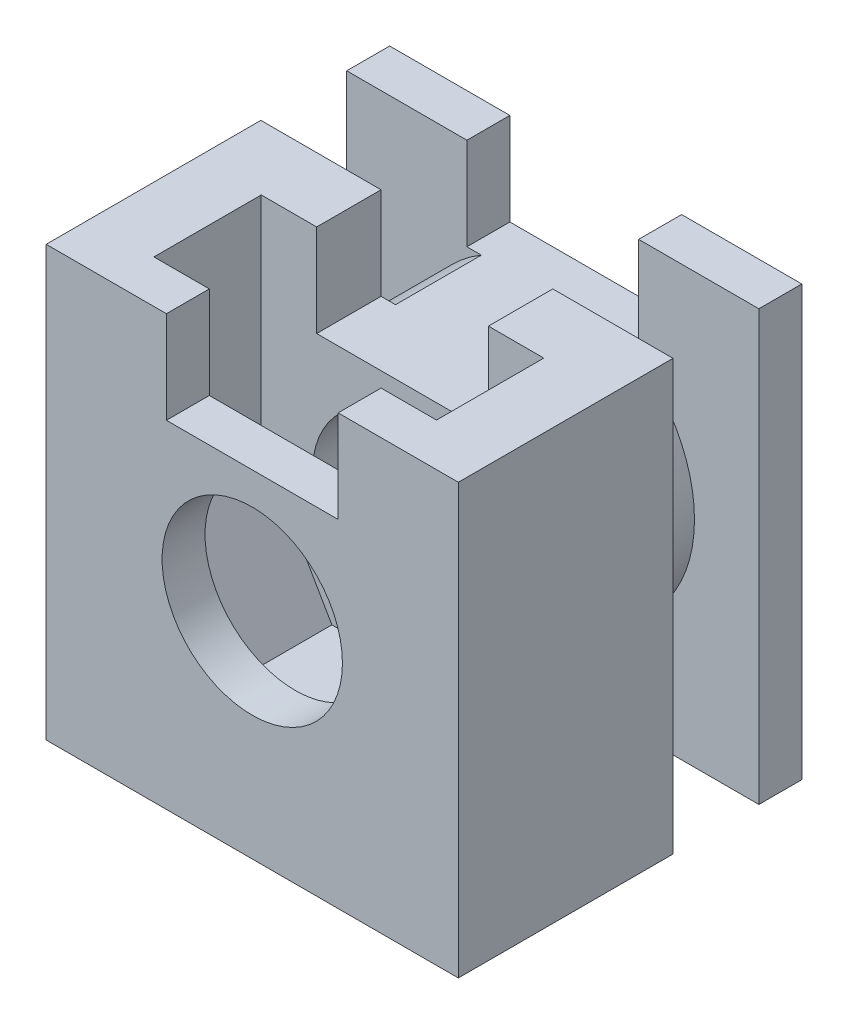
ISO-10303-21;
HEADER;
FILE_DESCRIPTION(('STEP AP214'),'2;1');
FILE_NAME('part.step','',(''),(''),'','','');
FILE_SCHEMA(('AUTOMOTIVE_DESIGN { 1 0 10303 214 1 1 1 1 }'));
ENDSEC;
DATA;
#1=APPLICATION_CONTEXT('core data for automotive mechanical design processes');
#2=APPLICATION_PROTOCOL_DEFINITION('international standard','automotive_design',2000,#1);
#3=PRODUCT_CONTEXT('',#1,'mechanical');
#4=PRODUCT('Part','Part','',(#3));
#5=PRODUCT_RELATED_PRODUCT_CATEGORY('part','',(#4));
#6=PRODUCT_DEFINITION_FORMATION('','',#4);
#7=PRODUCT_DEFINITION_CONTEXT('part definition',#1,'design');
#8=PRODUCT_DEFINITION('design','',#6,#7);
#9=PRODUCT_DEFINITION_SHAPE('','',#8);
#10=(LENGTH_UNIT() NAMED_UNIT(*) SI_UNIT(.MILLI.,.METRE.));
#11=(NAMED_UNIT(*) PLANE_ANGLE_UNIT() SI_UNIT($,.RADIAN.));
#12=(NAMED_UNIT(*) SI_UNIT($,.STERADIAN.) SOLID_ANGLE_UNIT());
#13=UNCERTAINTY_MEASURE_WITH_UNIT(LENGTH_MEASURE(1.E-05),#10,'distance_accuracy_value','');
#14=(GEOMETRIC_REPRESENTATION_CONTEXT(3) GLOBAL_UNCERTAINTY_ASSIGNED_CONTEXT((#13)) GLOBAL_UNIT_ASSIGNED_CONTEXT((#10,
#11,#12)) REPRESENTATION_CONTEXT('',''));
#15=CARTESIAN_POINT('',(0.,0.,0.));
#16=DIRECTION('',(0.,0.,1.));
#17=DIRECTION('',(1.,0.,0.));
#18=AXIS2_PLACEMENT_3D('',#15,#16,#17);
#19=CARTESIAN_POINT('',(0.,10.,0.));
#20=DIRECTION('',(0.,1.,0.));
#21=DIRECTION('',(0.,0.,1.));
#22=AXIS2_PLACEMENT_3D('',#19,#20,#21);
#23=PLANE('',#22);
#24=DIRECTION('',(0.,0.,1.));
#25=VECTOR('',#24,1.);
#26=CARTESIAN_POINT('',(-4.8,10.,0.));
#27=LINE('',#26,#25);
#28=CARTESIAN_POINT('',(-4.8,10.,0.));
#29=VERTEX_POINT('',#28);
#30=CARTESIAN_POINT('',(-4.8,10.,1.));
#31=VERTEX_POINT('',#30);
#32=EDGE_CURVE('E367',#29,#31,#27,.T.);
#33=ORIENTED_EDGE('',*,*,#32,.T.);
#34=DIRECTION('',(1.,0.,0.));
#35=VECTOR('',#34,1.);
#36=CARTESIAN_POINT('',(0.,10.,1.));
#37=LINE('',#36,#35);
#38=CARTESIAN_POINT('',(-2.,10.,1.));
#39=VERTEX_POINT('',#38);
#40=EDGE_CURVE('E518',#31,#39,#37,.T.);
#41=ORIENTED_EDGE('',*,*,#40,.T.);
#42=DIRECTION('',(0.,0.,-1.));
#43=VECTOR('',#42,1.);
#44=CARTESIAN_POINT('',(-2.,10.,0.));
#45=LINE('',#44,#43);
#46=CARTESIAN_POINT('',(-2.,10.,0.));
#47=VERTEX_POINT('',#46);
#48=EDGE_CURVE('E403',#39,#47,#45,.T.);
#49=ORIENTED_EDGE('',*,*,#48,.T.);
#50=DIRECTION('',(-1.,0.,0.));
#51=VECTOR('',#50,1.);
#52=CARTESIAN_POINT('',(4.8,10.,0.));
#53=LINE('',#52,#51);
#54=EDGE_CURVE('E361',#47,#29,#53,.T.);
#55=ORIENTED_EDGE('',*,*,#54,.T.);
#56=EDGE_LOOP('',(#33,#41,#49,#55));
#57=FACE_BOUND('',#56,.T.);
#58=ADVANCED_FACE('F33',(#57),#23,.T.);
#59=DIRECTION('',(0.,0.,1.));
#60=VECTOR('',#59,1.);
#61=CARTESIAN_POINT('',(2.,10.,0.));
#62=LINE('',#61,#60);
#63=CARTESIAN_POINT('',(2.,10.,0.));
#64=VERTEX_POINT('',#63);
#65=CARTESIAN_POINT('',(2.,10.,1.));
#66=VERTEX_POINT('',#65);
#67=EDGE_CURVE('E400',#64,#66,#62,.T.);
#68=ORIENTED_EDGE('',*,*,#67,.T.);
#69=DIRECTION('',(1.,0.,0.));
#70=VECTOR('',#69,1.);
#71=CARTESIAN_POINT('',(0.,10.,1.));
#72=LINE('',#71,#70);
#73=CARTESIAN_POINT('',(4.8,10.,1.));
#74=VERTEX_POINT('',#73);
#75=EDGE_CURVE('E48',#66,#74,#72,.T.);
#76=ORIENTED_EDGE('',*,*,#75,.T.);
#77=DIRECTION('',(0.,0.,-1.));
#78=VECTOR('',#77,1.);
#79=CARTESIAN_POINT('',(4.8,10.,8.));
#80=LINE('',#79,#78);
#81=CARTESIAN_POINT('',(4.8,10.,0.));
#82=VERTEX_POINT('',#81);
#83=EDGE_CURVE('E362',#74,#82,#80,.T.);
#84=ORIENTED_EDGE('',*,*,#83,.T.);
#85=EDGE_CURVE('E363',#82,#64,#53,.T.);
#86=ORIENTED_EDGE('',*,*,#85,.T.);
#87=EDGE_LOOP('',(#68,#76,#84,#86));
#88=FACE_BOUND('',#87,.T.);
#89=ADVANCED_FACE('F485',(#88),#23,.T.);
#90=CARTESIAN_POINT('',(4.8,10.,8.));
#91=DIRECTION('',(-1.,0.,0.));
#92=DIRECTION('',(0.,0.,1.));
#93=AXIS2_PLACEMENT_3D('',#90,#91,#92);
#94=PLANE('',#93);
#95=DIRECTION('',(0.,1.,0.));
#96=VECTOR('',#95,1.);
#97=CARTESIAN_POINT('',(4.8,10.,1.));
#98=LINE('',#97,#96);
#99=CARTESIAN_POINT('',(4.8,0.,1.));
#100=VERTEX_POINT('',#99);
#101=EDGE_CURVE('E526',#100,#74,#98,.T.);
#102=ORIENTED_EDGE('',*,*,#101,.F.);
#103=DIRECTION('',(0.,0.,-1.));
#104=VECTOR('',#103,1.);
#105=CARTESIAN_POINT('',(4.8,0.,8.));
#106=LINE('',#105,#104);
#107=CARTESIAN_POINT('',(4.8,0.,0.));
#108=VERTEX_POINT('',#107);
#109=EDGE_CURVE('E357',#100,#108,#106,.T.);
#110=ORIENTED_EDGE('',*,*,#109,.T.);
#111=DIRECTION('',(0.,-1.,0.));
#112=VECTOR('',#111,1.);
#113=CARTESIAN_POINT('',(4.8,10.,0.));
#114=LINE('',#113,#112);
#115=EDGE_CURVE('E394',#82,#108,#114,.T.);
#116=ORIENTED_EDGE('',*,*,#115,.F.);
#117=ORIENTED_EDGE('',*,*,#83,.F.);
#118=EDGE_LOOP('',(#102,#110,#116,#117));
#119=FACE_BOUND('',#118,.T.);
#120=ADVANCED_FACE('F491',(#119),#94,.F.);
#121=CARTESIAN_POINT('',(-4.8,10.,0.));
#122=DIRECTION('',(1.,0.,0.));
#123=DIRECTION('',(0.,0.,-1.));
#124=AXIS2_PLACEMENT_3D('',#121,#122,#123);
#125=PLANE('',#124);
#126=DIRECTION('',(0.,-1.,0.));
#127=VECTOR('',#126,1.);
#128=CARTESIAN_POINT('',(-4.8,10.,1.));
#129=LINE('',#128,#127);
#130=CARTESIAN_POINT('',(-4.8,0.,1.));
#131=VERTEX_POINT('',#130);
#132=EDGE_CURVE('E520',#31,#131,#129,.T.);
#133=ORIENTED_EDGE('',*,*,#132,.F.);
#134=ORIENTED_EDGE('',*,*,#32,.F.);
#135=DIRECTION('',(0.,-1.,0.));
#136=VECTOR('',#135,1.);
#137=CARTESIAN_POINT('',(-4.8,10.,0.));
#138=LINE('',#137,#136);
#139=CARTESIAN_POINT('',(-4.8,0.,0.));
#140=VERTEX_POINT('',#139);
#141=EDGE_CURVE('E391',#29,#140,#138,.T.);
#142=ORIENTED_EDGE('',*,*,#141,.T.);
#143=DIRECTION('',(0.,0.,1.));
#144=VECTOR('',#143,1.);
#145=CARTESIAN_POINT('',(-4.8,0.,0.));
#146=LINE('',#145,#144);
#147=EDGE_CURVE('E381',#140,#131,#146,.T.);
#148=ORIENTED_EDGE('',*,*,#147,.T.);
#149=EDGE_LOOP('',(#133,#134,#142,#148));
#150=FACE_BOUND('',#149,.T.);
#151=ADVANCED_FACE('F478',(#150),#125,.F.);
#152=CARTESIAN_POINT('',(0.,0.,0.));
#153=DIRECTION('',(0.,1.,0.));
#154=DIRECTION('',(0.,0.,1.));
#155=AXIS2_PLACEMENT_3D('',#152,#153,#154);
#156=PLANE('',#155);
#157=DIRECTION('',(1.,0.,0.));
#158=VECTOR('',#157,1.);
#159=CARTESIAN_POINT('',(0.,0.,1.));
#160=LINE('',#159,#158);
#161=EDGE_CURVE('E522',#131,#100,#160,.T.);
#162=ORIENTED_EDGE('',*,*,#161,.F.);
#163=ORIENTED_EDGE('',*,*,#147,.F.);
#164=DIRECTION('',(-1.,0.,0.));
#165=VECTOR('',#164,1.);
#166=CARTESIAN_POINT('',(0.,0.,0.));
#167=LINE('',#166,#165);
#168=EDGE_CURVE('E378',#108,#140,#167,.T.);
#169=ORIENTED_EDGE('',*,*,#168,.F.);
#170=ORIENTED_EDGE('',*,*,#109,.F.);
#171=EDGE_LOOP('',(#162,#163,#169,#170));
#172=FACE_BOUND('',#171,.T.);
#173=ADVANCED_FACE('F469',(#172),#156,.F.);
#174=CARTESIAN_POINT('',(-2.,10.,8.));
#175=DIRECTION('',(1.,0.,0.));
#176=DIRECTION('',(0.,0.,-1.));
#177=AXIS2_PLACEMENT_3D('',#174,#175,#176);
#178=PLANE('',#177);
#179=ORIENTED_EDGE('',*,*,#48,.F.);
#180=DIRECTION('',(0.,-1.,0.));
#181=VECTOR('',#180,1.);
#182=CARTESIAN_POINT('',(-2.,10.,1.));
#183=LINE('',#182,#181);
#184=CARTESIAN_POINT('',(-2.,7.85,1.));
#185=VERTEX_POINT('',#184);
#186=EDGE_CURVE('E248',#39,#185,#183,.T.);
#187=ORIENTED_EDGE('',*,*,#186,.T.);
#188=DIRECTION('',(0.,0.,-1.));
#189=VECTOR('',#188,1.);
#190=CARTESIAN_POINT('',(-2.,7.85,8.));
#191=LINE('',#190,#189);
#192=CARTESIAN_POINT('',(-2.,7.85,0.));
#193=VERTEX_POINT('',#192);
#194=EDGE_CURVE('E279',#185,#193,#191,.T.);
#195=ORIENTED_EDGE('',*,*,#194,.T.);
#196=DIRECTION('',(0.,-1.,0.));
#197=VECTOR('',#196,1.);
#198=CARTESIAN_POINT('',(-2.,10.,0.));
#199=LINE('',#198,#197);
#200=EDGE_CURVE('E250',#47,#193,#199,.T.);
#201=ORIENTED_EDGE('',*,*,#200,.F.);
#202=EDGE_LOOP('',(#179,#187,#195,#201));
#203=FACE_BOUND('',#202,.T.);
#204=ADVANCED_FACE('F482',(#203),#178,.T.);
#205=CARTESIAN_POINT('',(2.,7.85,8.));
#206=DIRECTION('',(-1.,0.,0.));
#207=DIRECTION('',(0.,-1.,0.));
#208=AXIS2_PLACEMENT_3D('',#205,#206,#207);
#209=PLANE('',#208);
#210=DIRECTION('',(0.,0.,-1.));
#211=VECTOR('',#210,1.);
#212=CARTESIAN_POINT('',(2.,7.85,8.));
#213=LINE('',#212,#211);
#214=CARTESIAN_POINT('',(2.,7.85,1.));
#215=VERTEX_POINT('',#214);
#216=CARTESIAN_POINT('',(2.,7.85,0.));
#217=VERTEX_POINT('',#216);
#218=EDGE_CURVE('E275',#215,#217,#213,.T.);
#219=ORIENTED_EDGE('',*,*,#218,.F.);
#220=DIRECTION('',(0.,1.,0.));
#221=VECTOR('',#220,1.);
#222=CARTESIAN_POINT('',(2.,7.85,1.));
#223=LINE('',#222,#221);
#224=EDGE_CURVE('E222',#215,#66,#223,.T.);
#225=ORIENTED_EDGE('',*,*,#224,.T.);
#226=ORIENTED_EDGE('',*,*,#67,.F.);
#227=DIRECTION('',(0.,1.,0.));
#228=VECTOR('',#227,1.);
#229=CARTESIAN_POINT('',(2.,7.85,0.));
#230=LINE('',#229,#228);
#231=EDGE_CURVE('E266',#217,#64,#230,.T.);
#232=ORIENTED_EDGE('',*,*,#231,.F.);
#233=EDGE_LOOP('',(#219,#225,#226,#232));
#234=FACE_BOUND('',#233,.T.);
#235=ADVANCED_FACE('F537',(#234),#209,.T.);
#236=CARTESIAN_POINT('',(0.,10.,0.));
#237=DIRECTION('',(0.,0.,1.));
#238=DIRECTION('',(1.,0.,0.));
#239=AXIS2_PLACEMENT_3D('',#236,#237,#238);
#240=PLANE('',#239);
#241=CARTESIAN_POINT('',(0.,5.,0.));
#242=DIRECTION('',(0.,0.,1.));
#243=DIRECTION('',(1.,0.,0.));
#244=AXIS2_PLACEMENT_3D('',#241,#242,#243);
#245=CIRCLE('',#244,2.1);
#246=CARTESIAN_POINT('',(2.1,5.,0.));
#247=VERTEX_POINT('',#246);
#248=EDGE_CURVE('E299',#247,#247,#245,.T.);
#249=ORIENTED_EDGE('',*,*,#248,.T.);
#250=EDGE_LOOP('',(#249));
#251=FACE_BOUND('',#250,.T.);
#252=ORIENTED_EDGE('',*,*,#200,.T.);
#253=DIRECTION('',(1.,0.,0.));
#254=VECTOR('',#253,1.);
#255=CARTESIAN_POINT('',(0.,7.85,0.));
#256=LINE('',#255,#254);
#257=EDGE_CURVE('E254',#193,#217,#256,.T.);
#258=ORIENTED_EDGE('',*,*,#257,.T.);
#259=ORIENTED_EDGE('',*,*,#231,.T.);
#260=ORIENTED_EDGE('',*,*,#85,.F.);
#261=ORIENTED_EDGE('',*,*,#115,.T.);
#262=ORIENTED_EDGE('',*,*,#168,.T.);
#263=ORIENTED_EDGE('',*,*,#141,.F.);
#264=ORIENTED_EDGE('',*,*,#54,.F.);
#265=EDGE_LOOP('',(#252,#258,#259,#260,#261,#262,#263,#264));
#266=FACE_BOUND('',#265,.T.);
#267=ADVANCED_FACE('F514',(#251,#266),#240,.F.);
#268=CARTESIAN_POINT('',(-4.8,10.,8.));
#269=DIRECTION('',(0.,0.,-1.));
#270=DIRECTION('',(-1.,0.,0.));
#271=AXIS2_PLACEMENT_3D('',#268,#269,#270);
#272=PLANE('',#271);
#273=CARTESIAN_POINT('',(0.,5.,8.));
#274=DIRECTION('',(0.,0.,1.));
#275=DIRECTION('',(1.,0.,0.));
#276=AXIS2_PLACEMENT_3D('',#273,#274,#275);
#277=CIRCLE('',#276,2.1);
#278=CARTESIAN_POINT('',(2.1,5.,8.));
#279=VERTEX_POINT('',#278);
#280=EDGE_CURVE('E300',#279,#279,#277,.T.);
#281=ORIENTED_EDGE('',*,*,#280,.F.);
#282=EDGE_LOOP('',(#281));
#283=FACE_BOUND('',#282,.T.);
#284=DIRECTION('',(0.,-1.,0.));
#285=VECTOR('',#284,1.);
#286=CARTESIAN_POINT('',(-2.,10.,8.));
#287=LINE('',#286,#285);
#288=CARTESIAN_POINT('',(-2.,10.,8.));
#289=VERTEX_POINT('',#288);
#290=CARTESIAN_POINT('',(-2.,7.85,8.));
#291=VERTEX_POINT('',#290);
#292=EDGE_CURVE('E263',#289,#291,#287,.T.);
#293=ORIENTED_EDGE('',*,*,#292,.F.);
#294=DIRECTION('',(1.,0.,0.));
#295=VECTOR('',#294,1.);
#296=CARTESIAN_POINT('',(-4.8,10.,8.));
#297=LINE('',#296,#295);
#298=CARTESIAN_POINT('',(-4.8,10.,8.));
#299=VERTEX_POINT('',#298);
#300=EDGE_CURVE('E371',#299,#289,#297,.T.);
#301=ORIENTED_EDGE('',*,*,#300,.F.);
#302=DIRECTION('',(0.,-1.,0.));
#303=VECTOR('',#302,1.);
#304=CARTESIAN_POINT('',(-4.8,10.,8.));
#305=LINE('',#304,#303);
#306=CARTESIAN_POINT('',(-4.8,0.,8.));
#307=VERTEX_POINT('',#306);
#308=EDGE_CURVE('E388',#299,#307,#305,.T.);
#309=ORIENTED_EDGE('',*,*,#308,.T.);
#310=DIRECTION('',(1.,0.,0.));
#311=VECTOR('',#310,1.);
#312=CARTESIAN_POINT('',(-4.8,0.,8.));
#313=LINE('',#312,#311);
#314=CARTESIAN_POINT('',(4.8,0.,8.));
#315=VERTEX_POINT('',#314);
#316=EDGE_CURVE('E384',#307,#315,#313,.T.);
#317=ORIENTED_EDGE('',*,*,#316,.T.);
#318=DIRECTION('',(0.,-1.,0.));
#319=VECTOR('',#318,1.);
#320=CARTESIAN_POINT('',(4.8,10.,8.));
#321=LINE('',#320,#319);
#322=CARTESIAN_POINT('',(4.8,10.,8.));
#323=VERTEX_POINT('',#322);
#324=EDGE_CURVE('E374',#323,#315,#321,.T.);
#325=ORIENTED_EDGE('',*,*,#324,.F.);
#326=CARTESIAN_POINT('',(2.,10.,8.));
#327=VERTEX_POINT('',#326);
#328=EDGE_CURVE('E370',#327,#323,#297,.T.);
#329=ORIENTED_EDGE('',*,*,#328,.F.);
#330=DIRECTION('',(0.,1.,0.));
#331=VECTOR('',#330,1.);
#332=CARTESIAN_POINT('',(2.,7.85,8.));
#333=LINE('',#332,#331);
#334=CARTESIAN_POINT('',(2.,7.85,8.));
#335=VERTEX_POINT('',#334);
#336=EDGE_CURVE('E56',#335,#327,#333,.T.);
#337=ORIENTED_EDGE('',*,*,#336,.F.);
#338=DIRECTION('',(1.,0.,0.));
#339=VECTOR('',#338,1.);
#340=CARTESIAN_POINT('',(-2.,7.85,8.));
#341=LINE('',#340,#339);
#342=EDGE_CURVE('E265',#291,#335,#341,.T.);
#343=ORIENTED_EDGE('',*,*,#342,.F.);
#344=EDGE_LOOP('',(#293,#301,#309,#317,#325,#329,#337,#343));
#345=FACE_BOUND('',#344,.T.);
#346=ADVANCED_FACE('F446',(#283,#345),#272,.F.);
#347=CARTESIAN_POINT('',(0.,0.,7.));
#348=DIRECTION('',(0.,0.,1.));
#349=DIRECTION('',(1.,0.,0.));
#350=AXIS2_PLACEMENT_3D('',#347,#348,#349);
#351=PLANE('',#350);
#352=CARTESIAN_POINT('',(0.,5.,7.));
#353=DIRECTION('',(0.,0.,1.));
#354=DIRECTION('',(1.,0.,0.));
#355=AXIS2_PLACEMENT_3D('',#352,#353,#354);
#356=CIRCLE('',#355,2.1);
#357=CARTESIAN_POINT('',(2.1,5.,7.));
#358=VERTEX_POINT('',#357);
#359=EDGE_CURVE('E306',#358,#358,#356,.F.);
#360=ORIENTED_EDGE('',*,*,#359,.F.);
#361=EDGE_LOOP('',(#360));
#362=FACE_BOUND('',#361,.T.);
#363=DIRECTION('',(0.,1.,0.));
#364=VECTOR('',#363,1.);
#365=CARTESIAN_POINT('',(-2.,0.,7.));
#366=LINE('',#365,#364);
#367=CARTESIAN_POINT('',(-2.,7.85,7.));
#368=VERTEX_POINT('',#367);
#369=CARTESIAN_POINT('',(-2.,10.,7.));
#370=VERTEX_POINT('',#369);
#371=EDGE_CURVE('E295',#368,#370,#366,.T.);
#372=ORIENTED_EDGE('',*,*,#371,.F.);
#373=DIRECTION('',(-1.,0.,0.));
#374=VECTOR('',#373,1.);
#375=CARTESIAN_POINT('',(0.,7.85,7.));
#376=LINE('',#375,#374);
#377=CARTESIAN_POINT('',(2.,7.85,7.));
#378=VERTEX_POINT('',#377);
#379=EDGE_CURVE('E297',#378,#368,#376,.T.);
#380=ORIENTED_EDGE('',*,*,#379,.F.);
#381=DIRECTION('',(0.,-1.,0.));
#382=VECTOR('',#381,1.);
#383=CARTESIAN_POINT('',(2.,0.,7.));
#384=LINE('',#383,#382);
#385=CARTESIAN_POINT('',(2.,10.,7.));
#386=VERTEX_POINT('',#385);
#387=EDGE_CURVE('E290',#386,#378,#384,.T.);
#388=ORIENTED_EDGE('',*,*,#387,.F.);
#389=DIRECTION('',(1.,0.,0.));
#390=VECTOR('',#389,1.);
#391=CARTESIAN_POINT('',(0.,10.,7.));
#392=LINE('',#391,#390);
#393=CARTESIAN_POINT('',(3.29089653438087,10.,7.));
#394=VERTEX_POINT('',#393);
#395=EDGE_CURVE('E323',#386,#394,#392,.T.);
#396=ORIENTED_EDGE('',*,*,#395,.T.);
#397=DIRECTION('',(0.,-1.,0.));
#398=VECTOR('',#397,1.);
#399=CARTESIAN_POINT('',(3.29089653438087,0.,7.));
#400=LINE('',#399,#398);
#401=CARTESIAN_POINT('',(3.29089653438087,5.,7.));
#402=VERTEX_POINT('',#401);
#403=EDGE_CURVE('E320',#394,#402,#400,.T.);
#404=ORIENTED_EDGE('',*,*,#403,.T.);
#405=DIRECTION('',(0.5,0.866025403784439,0.));
#406=VECTOR('',#405,1.);
#407=CARTESIAN_POINT('',(0.303108891324555,-0.175000000000001,7.));
#408=LINE('',#407,#406);
#409=CARTESIAN_POINT('',(1.64544826719043,2.15,7.));
#410=VERTEX_POINT('',#409);
#411=EDGE_CURVE('E318',#410,#402,#408,.T.);
#412=ORIENTED_EDGE('',*,*,#411,.F.);
#413=DIRECTION('',(1.,0.,0.));
#414=VECTOR('',#413,1.);
#415=CARTESIAN_POINT('',(0.,2.15,7.));
#416=LINE('',#415,#414);
#417=CARTESIAN_POINT('',(-1.64544826719044,2.15,7.));
#418=VERTEX_POINT('',#417);
#419=EDGE_CURVE('E316',#418,#410,#416,.T.);
#420=ORIENTED_EDGE('',*,*,#419,.F.);
#421=DIRECTION('',(0.5,-0.866025403784439,0.));
#422=VECTOR('',#421,1.);
#423=CARTESIAN_POINT('',(-0.303108891324555,-0.175000000000001,7.));
#424=LINE('',#423,#422);
#425=CARTESIAN_POINT('',(-3.29089653438087,5.,7.));
#426=VERTEX_POINT('',#425);
#427=EDGE_CURVE('E313',#426,#418,#424,.T.);
#428=ORIENTED_EDGE('',*,*,#427,.F.);
#429=DIRECTION('',(0.,1.,0.));
#430=VECTOR('',#429,1.);
#431=CARTESIAN_POINT('',(-3.29089653438087,0.,7.));
#432=LINE('',#431,#430);
#433=CARTESIAN_POINT('',(-3.29089653438087,10.,7.));
#434=VERTEX_POINT('',#433);
#435=EDGE_CURVE('E310',#426,#434,#432,.T.);
#436=ORIENTED_EDGE('',*,*,#435,.T.);
#437=EDGE_CURVE('E324',#434,#370,#392,.T.);
#438=ORIENTED_EDGE('',*,*,#437,.T.);
#439=EDGE_LOOP('',(#372,#380,#388,#396,#404,#412,#420,#428,#436,#438));
#440=FACE_BOUND('',#439,.T.);
#441=ADVANCED_FACE('F435',(#362,#440),#351,.F.);
#442=CARTESIAN_POINT('',(0.,0.,4.5));
#443=DIRECTION('',(0.,0.,1.));
#444=DIRECTION('',(1.,0.,0.));
#445=AXIS2_PLACEMENT_3D('',#442,#443,#444);
#446=PLANE('',#445);
#447=CARTESIAN_POINT('',(0.,5.,4.5));
#448=DIRECTION('',(0.,0.,1.));
#449=DIRECTION('',(1.,0.,0.));
#450=AXIS2_PLACEMENT_3D('',#447,#448,#449);
#451=CIRCLE('',#450,2.1);
#452=CARTESIAN_POINT('',(2.1,5.,4.5));
#453=VERTEX_POINT('',#452);
#454=EDGE_CURVE('E303',#453,#453,#451,.F.);
#455=ORIENTED_EDGE('',*,*,#454,.T.);
#456=EDGE_LOOP('',(#455));
#457=FACE_BOUND('',#456,.T.);
#458=DIRECTION('',(-1.,0.,0.));
#459=VECTOR('',#458,1.);
#460=CARTESIAN_POINT('',(0.,7.85,4.5));
#461=LINE('',#460,#459);
#462=CARTESIAN_POINT('',(2.,7.85,4.5));
#463=VERTEX_POINT('',#462);
#464=CARTESIAN_POINT('',(-2.,7.85,4.5));
#465=VERTEX_POINT('',#464);
#466=EDGE_CURVE('E407',#463,#465,#461,.T.);
#467=ORIENTED_EDGE('',*,*,#466,.T.);
#468=DIRECTION('',(0.,1.,0.));
#469=VECTOR('',#468,1.);
#470=CARTESIAN_POINT('',(-2.,0.,4.5));
#471=LINE('',#470,#469);
#472=CARTESIAN_POINT('',(-2.,10.,4.5));
#473=VERTEX_POINT('',#472);
#474=EDGE_CURVE('E292',#465,#473,#471,.T.);
#475=ORIENTED_EDGE('',*,*,#474,.T.);
#476=DIRECTION('',(1.,0.,0.));
#477=VECTOR('',#476,1.);
#478=CARTESIAN_POINT('',(0.,10.,4.5));
#479=LINE('',#478,#477);
#480=CARTESIAN_POINT('',(-3.29089653438087,10.,4.5));
#481=VERTEX_POINT('',#480);
#482=EDGE_CURVE('E314',#481,#473,#479,.T.);
#483=ORIENTED_EDGE('',*,*,#482,.F.);
#484=DIRECTION('',(0.,1.,0.));
#485=VECTOR('',#484,1.);
#486=CARTESIAN_POINT('',(-3.29089653438087,0.,4.5));
#487=LINE('',#486,#485);
#488=CARTESIAN_POINT('',(-3.29089653438087,5.,4.5));
#489=VERTEX_POINT('',#488);
#490=EDGE_CURVE('E309',#489,#481,#487,.T.);
#491=ORIENTED_EDGE('',*,*,#490,.F.);
#492=DIRECTION('',(0.5,-0.866025403784439,0.));
#493=VECTOR('',#492,1.);
#494=CARTESIAN_POINT('',(-0.303108891324555,-0.175000000000001,4.5));
#495=LINE('',#494,#493);
#496=CARTESIAN_POINT('',(-1.64544826719044,2.15,4.5));
#497=VERTEX_POINT('',#496);
#498=EDGE_CURVE('E329',#489,#497,#495,.T.);
#499=ORIENTED_EDGE('',*,*,#498,.T.);
#500=DIRECTION('',(1.,0.,0.));
#501=VECTOR('',#500,1.);
#502=CARTESIAN_POINT('',(0.,2.15,4.5));
#503=LINE('',#502,#501);
#504=CARTESIAN_POINT('',(1.64544826719043,2.15,4.5));
#505=VERTEX_POINT('',#504);
#506=EDGE_CURVE('E331',#497,#505,#503,.T.);
#507=ORIENTED_EDGE('',*,*,#506,.T.);
#508=DIRECTION('',(0.5,0.866025403784439,0.));
#509=VECTOR('',#508,1.);
#510=CARTESIAN_POINT('',(0.303108891324555,-0.175000000000001,4.5));
#511=LINE('',#510,#509);
#512=CARTESIAN_POINT('',(3.29089653438087,5.,4.5));
#513=VERTEX_POINT('',#512);
#514=EDGE_CURVE('E333',#505,#513,#511,.T.);
#515=ORIENTED_EDGE('',*,*,#514,.T.);
#516=DIRECTION('',(0.,-1.,0.));
#517=VECTOR('',#516,1.);
#518=CARTESIAN_POINT('',(3.29089653438087,0.,4.5));
#519=LINE('',#518,#517);
#520=CARTESIAN_POINT('',(3.29089653438087,10.,4.5));
#521=VERTEX_POINT('',#520);
#522=EDGE_CURVE('E336',#521,#513,#519,.T.);
#523=ORIENTED_EDGE('',*,*,#522,.F.);
#524=CARTESIAN_POINT('',(2.,10.,4.5));
#525=VERTEX_POINT('',#524);
#526=EDGE_CURVE('E339',#525,#521,#479,.T.);
#527=ORIENTED_EDGE('',*,*,#526,.F.);
#528=DIRECTION('',(0.,-1.,0.));
#529=VECTOR('',#528,1.);
#530=CARTESIAN_POINT('',(2.,0.,4.5));
#531=LINE('',#530,#529);
#532=EDGE_CURVE('E287',#525,#463,#531,.T.);
#533=ORIENTED_EDGE('',*,*,#532,.T.);
#534=EDGE_LOOP('',(#467,#475,#483,#491,#499,#507,#515,#523,#527,#533));
#535=FACE_BOUND('',#534,.T.);
#536=ADVANCED_FACE('F425',(#457,#535),#446,.T.);
#537=DIRECTION('',(1.,0.,0.));
#538=VECTOR('',#537,1.);
#539=CARTESIAN_POINT('',(0.,10.,3.));
#540=LINE('',#539,#538);
#541=CARTESIAN_POINT('',(-4.8,10.,3.));
#542=VERTEX_POINT('',#541);
#543=CARTESIAN_POINT('',(-2.,10.,3.));
#544=VERTEX_POINT('',#543);
#545=EDGE_CURVE('E256',#542,#544,#540,.T.);
#546=ORIENTED_EDGE('',*,*,#545,.F.);
#547=EDGE_CURVE('E366',#542,#299,#27,.T.);
#548=ORIENTED_EDGE('',*,*,#547,.T.);
#549=ORIENTED_EDGE('',*,*,#300,.T.);
#550=DIRECTION('',(0.,0.,-1.));
#551=VECTOR('',#550,1.);
#552=CARTESIAN_POINT('',(-2.,10.,8.));
#553=LINE('',#552,#551);
#554=EDGE_CURVE('E283',#289,#370,#553,.T.);
#555=ORIENTED_EDGE('',*,*,#554,.T.);
#556=ORIENTED_EDGE('',*,*,#437,.F.);
#557=DIRECTION('',(0.,0.,-1.));
#558=VECTOR('',#557,1.);
#559=CARTESIAN_POINT('',(-3.29089653438087,10.,7.));
#560=LINE('',#559,#558);
#561=EDGE_CURVE('E327',#434,#481,#560,.T.);
#562=ORIENTED_EDGE('',*,*,#561,.T.);
#563=ORIENTED_EDGE('',*,*,#482,.T.);
#564=EDGE_CURVE('E404',#473,#544,#45,.T.);
#565=ORIENTED_EDGE('',*,*,#564,.T.);
#566=EDGE_LOOP('',(#546,#548,#549,#555,#556,#562,#563,#565));
#567=FACE_BOUND('',#566,.T.);
#568=ADVANCED_FACE('F487',(#567),#23,.T.);
#569=DIRECTION('',(1.,0.,0.));
#570=VECTOR('',#569,1.);
#571=CARTESIAN_POINT('',(0.,10.,3.));
#572=LINE('',#571,#570);
#573=CARTESIAN_POINT('',(2.,10.,3.));
#574=VERTEX_POINT('',#573);
#575=CARTESIAN_POINT('',(4.8,10.,3.));
#576=VERTEX_POINT('',#575);
#577=EDGE_CURVE('E243',#574,#576,#572,.T.);
#578=ORIENTED_EDGE('',*,*,#577,.F.);
#579=EDGE_CURVE('E397',#574,#525,#62,.T.);
#580=ORIENTED_EDGE('',*,*,#579,.T.);
#581=ORIENTED_EDGE('',*,*,#526,.T.);
#582=DIRECTION('',(0.,0.,-1.));
#583=VECTOR('',#582,1.);
#584=CARTESIAN_POINT('',(3.29089653438087,10.,7.));
#585=LINE('',#584,#583);
#586=EDGE_CURVE('E344',#394,#521,#585,.T.);
#587=ORIENTED_EDGE('',*,*,#586,.F.);
#588=ORIENTED_EDGE('',*,*,#395,.F.);
#589=DIRECTION('',(0.,0.,-1.));
#590=VECTOR('',#589,1.);
#591=CARTESIAN_POINT('',(2.,10.,8.));
#592=LINE('',#591,#590);
#593=EDGE_CURVE('E268',#327,#386,#592,.T.);
#594=ORIENTED_EDGE('',*,*,#593,.F.);
#595=ORIENTED_EDGE('',*,*,#328,.T.);
#596=EDGE_CURVE('E358',#323,#576,#80,.T.);
#597=ORIENTED_EDGE('',*,*,#596,.T.);
#598=EDGE_LOOP('',(#578,#580,#581,#587,#588,#594,#595,#597));
#599=FACE_BOUND('',#598,.T.);
#600=ADVANCED_FACE('F418',(#599),#23,.T.);
#601=CARTESIAN_POINT('',(4.8,0.,3.));
#602=VERTEX_POINT('',#601);
#603=EDGE_CURVE('E375',#315,#602,#106,.T.);
#604=ORIENTED_EDGE('',*,*,#603,.T.);
#605=DIRECTION('',(0.,1.,0.));
#606=VECTOR('',#605,1.);
#607=CARTESIAN_POINT('',(4.8,10.,3.));
#608=LINE('',#607,#606);
#609=EDGE_CURVE('E246',#602,#576,#608,.T.);
#610=ORIENTED_EDGE('',*,*,#609,.T.);
#611=ORIENTED_EDGE('',*,*,#596,.F.);
#612=ORIENTED_EDGE('',*,*,#324,.T.);
#613=EDGE_LOOP('',(#604,#610,#611,#612));
#614=FACE_BOUND('',#613,.T.);
#615=ADVANCED_FACE('F35',(#614),#94,.F.);
#616=ORIENTED_EDGE('',*,*,#547,.F.);
#617=DIRECTION('',(0.,-1.,0.));
#618=VECTOR('',#617,1.);
#619=CARTESIAN_POINT('',(-4.8,10.,3.));
#620=LINE('',#619,#618);
#621=CARTESIAN_POINT('',(-4.8,0.,3.));
#622=VERTEX_POINT('',#621);
#623=EDGE_CURVE('E259',#542,#622,#620,.T.);
#624=ORIENTED_EDGE('',*,*,#623,.T.);
#625=EDGE_CURVE('E380',#622,#307,#146,.T.);
#626=ORIENTED_EDGE('',*,*,#625,.T.);
#627=ORIENTED_EDGE('',*,*,#308,.F.);
#628=EDGE_LOOP('',(#616,#624,#626,#627));
#629=FACE_BOUND('',#628,.T.);
#630=ADVANCED_FACE('F461',(#629),#125,.F.);
#631=ORIENTED_EDGE('',*,*,#625,.F.);
#632=DIRECTION('',(1.,0.,0.));
#633=VECTOR('',#632,1.);
#634=CARTESIAN_POINT('',(0.,0.,3.));
#635=LINE('',#634,#633);
#636=EDGE_CURVE('E454',#622,#602,#635,.T.);
#637=ORIENTED_EDGE('',*,*,#636,.T.);
#638=ORIENTED_EDGE('',*,*,#603,.F.);
#639=ORIENTED_EDGE('',*,*,#316,.F.);
#640=EDGE_LOOP('',(#631,#637,#638,#639));
#641=FACE_BOUND('',#640,.T.);
#642=ADVANCED_FACE('F465',(#641),#156,.F.);
#643=CARTESIAN_POINT('',(-3.29089653438087,0.,7.));
#644=DIRECTION('',(-1.,0.,0.));
#645=DIRECTION('',(0.,0.,1.));
#646=AXIS2_PLACEMENT_3D('',#643,#644,#645);
#647=PLANE('',#646);
#648=ORIENTED_EDGE('',*,*,#490,.T.);
#649=ORIENTED_EDGE('',*,*,#561,.F.);
#650=ORIENTED_EDGE('',*,*,#435,.F.);
#651=DIRECTION('',(0.,0.,-1.));
#652=VECTOR('',#651,1.);
#653=CARTESIAN_POINT('',(-3.29089653438087,5.,7.));
#654=LINE('',#653,#652);
#655=EDGE_CURVE('E355',#426,#489,#654,.T.);
#656=ORIENTED_EDGE('',*,*,#655,.T.);
#657=EDGE_LOOP('',(#648,#649,#650,#656));
#658=FACE_BOUND('',#657,.T.);
#659=ADVANCED_FACE('F467',(#658),#647,.F.);
#660=CARTESIAN_POINT('',(-0.303108891324555,-0.175000000000001,7.));
#661=DIRECTION('',(0.866025403784439,0.5,0.));
#662=DIRECTION('',(-0.5,0.866025403784439,0.));
#663=AXIS2_PLACEMENT_3D('',#660,#661,#662);
#664=PLANE('',#663);
#665=ORIENTED_EDGE('',*,*,#498,.F.);
#666=ORIENTED_EDGE('',*,*,#655,.F.);
#667=ORIENTED_EDGE('',*,*,#427,.T.);
#668=DIRECTION('',(0.,0.,-1.));
#669=VECTOR('',#668,1.);
#670=CARTESIAN_POINT('',(-1.64544826719044,2.15,7.));
#671=LINE('',#670,#669);
#672=EDGE_CURVE('E352',#418,#497,#671,.T.);
#673=ORIENTED_EDGE('',*,*,#672,.T.);
#674=EDGE_LOOP('',(#665,#666,#667,#673));
#675=FACE_BOUND('',#674,.T.);
#676=ADVANCED_FACE('F474',(#675),#664,.T.);
#677=CARTESIAN_POINT('',(0.,2.15,7.));
#678=DIRECTION('',(0.,1.,0.));
#679=DIRECTION('',(0.,0.,1.));
#680=AXIS2_PLACEMENT_3D('',#677,#678,#679);
#681=PLANE('',#680);
#682=ORIENTED_EDGE('',*,*,#506,.F.);
#683=ORIENTED_EDGE('',*,*,#672,.F.);
#684=ORIENTED_EDGE('',*,*,#419,.T.);
#685=DIRECTION('',(0.,0.,-1.));
#686=VECTOR('',#685,1.);
#687=CARTESIAN_POINT('',(1.64544826719043,2.15,7.));
#688=LINE('',#687,#686);
#689=EDGE_CURVE('E349',#410,#505,#688,.T.);
#690=ORIENTED_EDGE('',*,*,#689,.T.);
#691=EDGE_LOOP('',(#682,#683,#684,#690));
#692=FACE_BOUND('',#691,.T.);
#693=ADVANCED_FACE('F679',(#692),#681,.T.);
#694=CARTESIAN_POINT('',(0.303108891324555,-0.175000000000001,7.));
#695=DIRECTION('',(-0.866025403784439,0.5,0.));
#696=DIRECTION('',(-0.5,-0.866025403784439,0.));
#697=AXIS2_PLACEMENT_3D('',#694,#695,#696);
#698=PLANE('',#697);
#699=ORIENTED_EDGE('',*,*,#514,.F.);
#700=ORIENTED_EDGE('',*,*,#689,.F.);
#701=ORIENTED_EDGE('',*,*,#411,.T.);
#702=DIRECTION('',(0.,0.,-1.));
#703=VECTOR('',#702,1.);
#704=CARTESIAN_POINT('',(3.29089653438087,5.,7.));
#705=LINE('',#704,#703);
#706=EDGE_CURVE('E347',#402,#513,#705,.T.);
#707=ORIENTED_EDGE('',*,*,#706,.T.);
#708=EDGE_LOOP('',(#699,#700,#701,#707));
#709=FACE_BOUND('',#708,.T.);
#710=ADVANCED_FACE('F688',(#709),#698,.T.);
#711=CARTESIAN_POINT('',(3.29089653438087,0.,7.));
#712=DIRECTION('',(1.,0.,0.));
#713=DIRECTION('',(0.,0.,-1.));
#714=AXIS2_PLACEMENT_3D('',#711,#712,#713);
#715=PLANE('',#714);
#716=ORIENTED_EDGE('',*,*,#522,.T.);
#717=ORIENTED_EDGE('',*,*,#706,.F.);
#718=ORIENTED_EDGE('',*,*,#403,.F.);
#719=ORIENTED_EDGE('',*,*,#586,.T.);
#720=EDGE_LOOP('',(#716,#717,#718,#719));
#721=FACE_BOUND('',#720,.T.);
#722=ADVANCED_FACE('F430',(#721),#715,.F.);
#723=CARTESIAN_POINT('',(0.,5.,8.));
#724=DIRECTION('',(0.,0.,-1.));
#725=DIRECTION('',(-1.,0.,0.));
#726=AXIS2_PLACEMENT_3D('',#723,#724,#725);
#727=CYLINDRICAL_SURFACE('',#726,2.1);
#728=ORIENTED_EDGE('',*,*,#454,.F.);
#729=EDGE_LOOP('',(#728));
#730=FACE_BOUND('',#729,.T.);
#731=ORIENTED_EDGE('',*,*,#248,.F.);
#732=EDGE_LOOP('',(#731));
#733=FACE_BOUND('',#732,.T.);
#734=ADVANCED_FACE('F703',(#730,#733),#727,.F.);
#735=ORIENTED_EDGE('',*,*,#280,.T.);
#736=EDGE_LOOP('',(#735));
#737=FACE_BOUND('',#736,.T.);
#738=ORIENTED_EDGE('',*,*,#359,.T.);
#739=EDGE_LOOP('',(#738));
#740=FACE_BOUND('',#739,.T.);
#741=ADVANCED_FACE('F743',(#737,#740),#727,.F.);
#742=ORIENTED_EDGE('',*,*,#371,.T.);
#743=ORIENTED_EDGE('',*,*,#554,.F.);
#744=ORIENTED_EDGE('',*,*,#292,.T.);
#745=EDGE_CURVE('E280',#291,#368,#191,.T.);
#746=ORIENTED_EDGE('',*,*,#745,.T.);
#747=EDGE_LOOP('',(#742,#743,#744,#746));
#748=FACE_BOUND('',#747,.T.);
#749=ADVANCED_FACE('F546',(#748),#178,.T.);
#750=ORIENTED_EDGE('',*,*,#387,.T.);
#751=EDGE_CURVE('E276',#335,#378,#213,.T.);
#752=ORIENTED_EDGE('',*,*,#751,.F.);
#753=ORIENTED_EDGE('',*,*,#336,.T.);
#754=ORIENTED_EDGE('',*,*,#593,.T.);
#755=EDGE_LOOP('',(#750,#752,#753,#754));
#756=FACE_BOUND('',#755,.T.);
#757=ADVANCED_FACE('F439',(#756),#209,.T.);
#758=CARTESIAN_POINT('',(0.,7.85,8.));
#759=DIRECTION('',(0.,1.,0.));
#760=DIRECTION('',(0.,0.,1.));
#761=AXIS2_PLACEMENT_3D('',#758,#759,#760);
#762=PLANE('',#761);
#763=ORIENTED_EDGE('',*,*,#379,.T.);
#764=ORIENTED_EDGE('',*,*,#745,.F.);
#765=ORIENTED_EDGE('',*,*,#342,.T.);
#766=ORIENTED_EDGE('',*,*,#751,.T.);
#767=EDGE_LOOP('',(#763,#764,#765,#766));
#768=FACE_BOUND('',#767,.T.);
#769=ADVANCED_FACE('F441',(#768),#762,.T.);
#770=DIRECTION('',(0.,-1.,0.));
#771=VECTOR('',#770,1.);
#772=CARTESIAN_POINT('',(-2.,10.,3.));
#773=LINE('',#772,#771);
#774=CARTESIAN_POINT('',(-2.,7.85,3.));
#775=VERTEX_POINT('',#774);
#776=EDGE_CURVE('E251',#544,#775,#773,.T.);
#777=ORIENTED_EDGE('',*,*,#776,.F.);
#778=ORIENTED_EDGE('',*,*,#564,.F.);
#779=ORIENTED_EDGE('',*,*,#474,.F.);
#780=EDGE_CURVE('E284',#465,#775,#191,.T.);
#781=ORIENTED_EDGE('',*,*,#780,.T.);
#782=EDGE_LOOP('',(#777,#778,#779,#781));
#783=FACE_BOUND('',#782,.T.);
#784=ADVANCED_FACE('F503',(#783),#178,.T.);
#785=DIRECTION('',(1.,0.,0.));
#786=VECTOR('',#785,1.);
#787=CARTESIAN_POINT('',(0.,7.85,3.));
#788=LINE('',#787,#786);
#789=CARTESIAN_POINT('',(1.66358047596142,7.85,3.));
#790=VERTEX_POINT('',#789);
#791=CARTESIAN_POINT('',(2.,7.85,3.));
#792=VERTEX_POINT('',#791);
#793=EDGE_CURVE('E238',#790,#792,#788,.T.);
#794=ORIENTED_EDGE('',*,*,#793,.F.);
#795=DIRECTION('',(0.,0.,-1.));
#796=VECTOR('',#795,1.);
#797=CARTESIAN_POINT('',(1.66358047596142,7.85,3.));
#798=LINE('',#797,#796);
#799=CARTESIAN_POINT('',(1.66358047596142,7.85,1.));
#800=VERTEX_POINT('',#799);
#801=EDGE_CURVE('E11',#800,#790,#798,.F.);
#802=ORIENTED_EDGE('',*,*,#801,.F.);
#803=DIRECTION('',(1.,0.,0.));
#804=VECTOR('',#803,1.);
#805=CARTESIAN_POINT('',(0.,7.85,1.));
#806=LINE('',#805,#804);
#807=EDGE_CURVE('E217',#800,#215,#806,.T.);
#808=ORIENTED_EDGE('',*,*,#807,.T.);
#809=ORIENTED_EDGE('',*,*,#218,.T.);
#810=ORIENTED_EDGE('',*,*,#257,.F.);
#811=ORIENTED_EDGE('',*,*,#194,.F.);
#812=CARTESIAN_POINT('',(-1.66358047596141,7.85,1.));
#813=VERTEX_POINT('',#812);
#814=EDGE_CURVE('E228',#185,#813,#806,.T.);
#815=ORIENTED_EDGE('',*,*,#814,.T.);
#816=DIRECTION('',(0.,0.,-1.));
#817=VECTOR('',#816,1.);
#818=CARTESIAN_POINT('',(-1.66358047596141,7.85,3.));
#819=LINE('',#818,#817);
#820=CARTESIAN_POINT('',(-1.66358047596141,7.85,3.));
#821=VERTEX_POINT('',#820);
#822=EDGE_CURVE('E41',#821,#813,#819,.T.);
#823=ORIENTED_EDGE('',*,*,#822,.F.);
#824=EDGE_CURVE('E245',#775,#821,#788,.T.);
#825=ORIENTED_EDGE('',*,*,#824,.F.);
#826=ORIENTED_EDGE('',*,*,#780,.F.);
#827=ORIENTED_EDGE('',*,*,#466,.F.);
#828=EDGE_CURVE('E240',#463,#792,#213,.T.);
#829=ORIENTED_EDGE('',*,*,#828,.T.);
#830=EDGE_LOOP('',(#794,#802,#808,#809,#810,#811,#815,#823,#825,#826,#827,#829));
#831=FACE_BOUND('',#830,.T.);
#832=ADVANCED_FACE('F236',(#831),#762,.T.);
#833=DIRECTION('',(0.,1.,0.));
#834=VECTOR('',#833,1.);
#835=CARTESIAN_POINT('',(2.,7.85,3.));
#836=LINE('',#835,#834);
#837=EDGE_CURVE('E411',#792,#574,#836,.T.);
#838=ORIENTED_EDGE('',*,*,#837,.F.);
#839=ORIENTED_EDGE('',*,*,#828,.F.);
#840=ORIENTED_EDGE('',*,*,#532,.F.);
#841=ORIENTED_EDGE('',*,*,#579,.F.);
#842=EDGE_LOOP('',(#838,#839,#840,#841));
#843=FACE_BOUND('',#842,.T.);
#844=ADVANCED_FACE('F421',(#843),#209,.T.);
#845=CARTESIAN_POINT('',(0.,0.,3.));
#846=DIRECTION('',(0.,0.,1.));
#847=DIRECTION('',(1.,0.,0.));
#848=AXIS2_PLACEMENT_3D('',#845,#846,#847);
#849=PLANE('',#848);
#850=ORIENTED_EDGE('',*,*,#824,.T.);
#851=CARTESIAN_POINT('',(0.,5.,3.));
#852=DIRECTION('',(0.,0.,1.));
#853=DIRECTION('',(1.,0.,0.));
#854=AXIS2_PLACEMENT_3D('',#851,#852,#853);
#855=CIRCLE('',#854,3.3);
#856=EDGE_CURVE('E226',#821,#790,#855,.T.);
#857=ORIENTED_EDGE('',*,*,#856,.T.);
#858=ORIENTED_EDGE('',*,*,#793,.T.);
#859=ORIENTED_EDGE('',*,*,#837,.T.);
#860=ORIENTED_EDGE('',*,*,#577,.T.);
#861=ORIENTED_EDGE('',*,*,#609,.F.);
#862=ORIENTED_EDGE('',*,*,#636,.F.);
#863=ORIENTED_EDGE('',*,*,#623,.F.);
#864=ORIENTED_EDGE('',*,*,#545,.T.);
#865=ORIENTED_EDGE('',*,*,#776,.T.);
#866=EDGE_LOOP('',(#850,#857,#858,#859,#860,#861,#862,#863,#864,#865));
#867=FACE_BOUND('',#866,.T.);
#868=ADVANCED_FACE('F413',(#867),#849,.F.);
#869=CARTESIAN_POINT('',(0.,0.,1.));
#870=DIRECTION('',(0.,0.,1.));
#871=DIRECTION('',(1.,0.,0.));
#872=AXIS2_PLACEMENT_3D('',#869,#870,#871);
#873=PLANE('',#872);
#874=ORIENTED_EDGE('',*,*,#186,.F.);
#875=ORIENTED_EDGE('',*,*,#40,.F.);
#876=ORIENTED_EDGE('',*,*,#132,.T.);
#877=ORIENTED_EDGE('',*,*,#161,.T.);
#878=ORIENTED_EDGE('',*,*,#101,.T.);
#879=ORIENTED_EDGE('',*,*,#75,.F.);
#880=ORIENTED_EDGE('',*,*,#224,.F.);
#881=ORIENTED_EDGE('',*,*,#807,.F.);
#882=CARTESIAN_POINT('',(0.,5.,1.));
#883=DIRECTION('',(0.,0.,1.));
#884=DIRECTION('',(1.,0.,0.));
#885=AXIS2_PLACEMENT_3D('',#882,#883,#884);
#886=CIRCLE('',#885,3.3);
#887=EDGE_CURVE('E220',#813,#800,#886,.T.);
#888=ORIENTED_EDGE('',*,*,#887,.F.);
#889=ORIENTED_EDGE('',*,*,#814,.F.);
#890=EDGE_LOOP('',(#874,#875,#876,#877,#878,#879,#880,#881,#888,#889));
#891=FACE_BOUND('',#890,.T.);
#892=ADVANCED_FACE('F219',(#891),#873,.T.);
#893=CARTESIAN_POINT('',(0.,5.,3.));
#894=DIRECTION('',(0.,0.,-1.));
#895=DIRECTION('',(-1.,0.,0.));
#896=AXIS2_PLACEMENT_3D('',#893,#894,#895);
#897=CYLINDRICAL_SURFACE('',#896,3.3);
#898=ORIENTED_EDGE('',*,*,#801,.T.);
#899=ORIENTED_EDGE('',*,*,#856,.F.);
#900=ORIENTED_EDGE('',*,*,#822,.T.);
#901=ORIENTED_EDGE('',*,*,#887,.T.);
#902=EDGE_LOOP('',(#898,#899,#900,#901));
#903=FACE_BOUND('',#902,.T.);
#904=ADVANCED_FACE('F230',(#903),#897,.T.);
#905=CLOSED_SHELL('',(#58,#89,#120,#151,#173,#204,#235,#267,#346,#441,#536,#568,#600,#615,#630,
#642,#659,#676,#693,#710,#722,#734,#741,#749,#757,#769,#784,#832,#844,#868,#892,#904));
#906=MANIFOLD_SOLID_BREP('B2',#905);
#907=ADVANCED_BREP_SHAPE_REPRESENTATION('',(#18,#906),#14);
#908=SHAPE_DEFINITION_REPRESENTATION(#9,#907);
ENDSEC;
END-ISO-10303-21;
